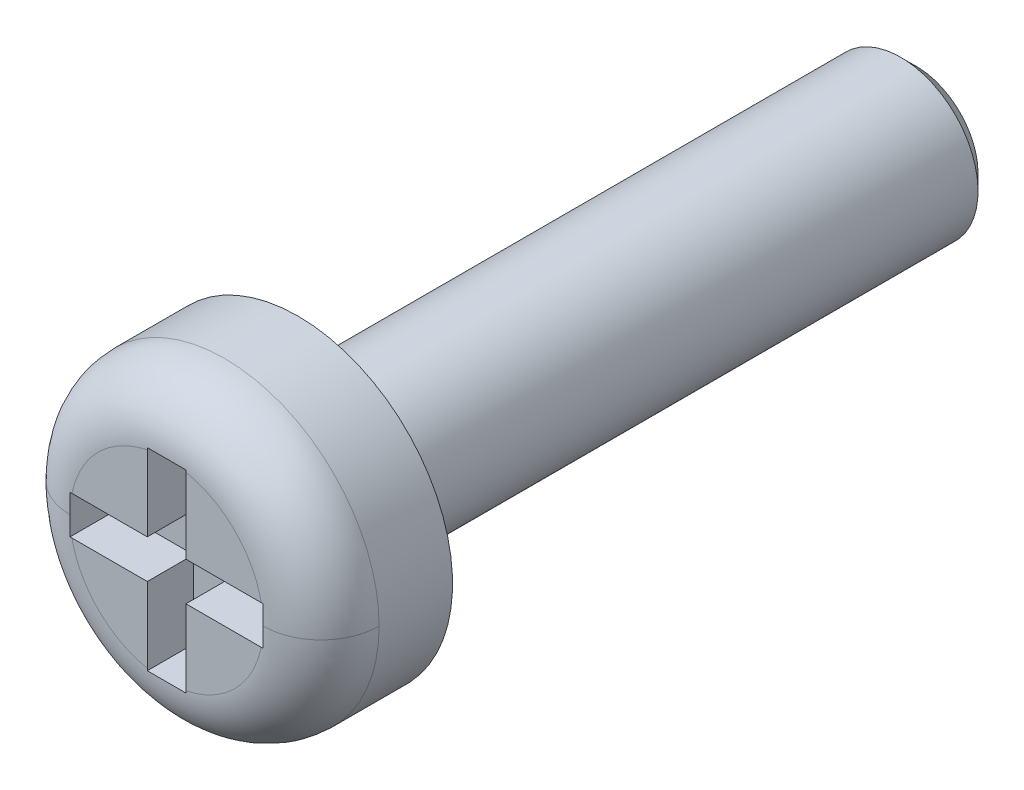
ISO-10303-21;
HEADER;
FILE_DESCRIPTION(('STEP AP214'),'2;1');
FILE_NAME('part.step','',(''),(''),'','','');
FILE_SCHEMA(('AUTOMOTIVE_DESIGN { 1 0 10303 214 1 1 1 1 }'));
ENDSEC;
DATA;
#1=APPLICATION_CONTEXT('core data for automotive mechanical design processes');
#2=APPLICATION_PROTOCOL_DEFINITION('international standard','automotive_design',2000,#1);
#3=PRODUCT_CONTEXT('',#1,'mechanical');
#4=PRODUCT('Part','Part','',(#3));
#5=PRODUCT_RELATED_PRODUCT_CATEGORY('part','',(#4));
#6=PRODUCT_DEFINITION_FORMATION('','',#4);
#7=PRODUCT_DEFINITION_CONTEXT('part definition',#1,'design');
#8=PRODUCT_DEFINITION('design','',#6,#7);
#9=PRODUCT_DEFINITION_SHAPE('','',#8);
#10=(LENGTH_UNIT() NAMED_UNIT(*) SI_UNIT(.MILLI.,.METRE.));
#11=(NAMED_UNIT(*) PLANE_ANGLE_UNIT() SI_UNIT($,.RADIAN.));
#12=(NAMED_UNIT(*) SI_UNIT($,.STERADIAN.) SOLID_ANGLE_UNIT());
#13=UNCERTAINTY_MEASURE_WITH_UNIT(LENGTH_MEASURE(1.E-05),#10,'distance_accuracy_value','');
#14=(GEOMETRIC_REPRESENTATION_CONTEXT(3) GLOBAL_UNCERTAINTY_ASSIGNED_CONTEXT((#13)) GLOBAL_UNIT_ASSIGNED_CONTEXT((#10,
#11,#12)) REPRESENTATION_CONTEXT('',''));
#15=CARTESIAN_POINT('',(0.,0.,0.));
#16=DIRECTION('',(0.,0.,1.));
#17=DIRECTION('',(1.,0.,0.));
#18=AXIS2_PLACEMENT_3D('',#15,#16,#17);
#19=CARTESIAN_POINT('',(-0.25,1.25,1.09999999999999));
#20=DIRECTION('',(0.,0.,-1.));
#21=DIRECTION('',(0.,1.,0.));
#22=AXIS2_PLACEMENT_3D('',#19,#20,#21);
#23=PLANE('',#22);
#24=DIRECTION('',(0.,-1.,0.));
#25=VECTOR('',#24,1.);
#26=CARTESIAN_POINT('',(-1.25,0.250000000000014,1.09999999999999));
#27=LINE('',#26,#25);
#28=CARTESIAN_POINT('',(-1.25,0.250000000000014,1.09999999999999));
#29=VERTEX_POINT('',#28);
#30=CARTESIAN_POINT('',(-1.25,-0.249999999999986,1.09999999999999));
#31=VERTEX_POINT('',#30);
#32=EDGE_CURVE('E157',#29,#31,#27,.T.);
#33=ORIENTED_EDGE('',*,*,#32,.T.);
#34=DIRECTION('',(1.,0.,0.));
#35=VECTOR('',#34,1.);
#36=CARTESIAN_POINT('',(-1.25000000000001,-0.249999999999986,1.09999999999999));
#37=LINE('',#36,#35);
#38=CARTESIAN_POINT('',(-0.250000000000004,-0.249999999999998,1.09999999999999));
#39=VERTEX_POINT('',#38);
#40=EDGE_CURVE('E153',#31,#39,#37,.T.);
#41=ORIENTED_EDGE('',*,*,#40,.T.);
#42=DIRECTION('',(0.,-1.,0.));
#43=VECTOR('',#42,1.);
#44=CARTESIAN_POINT('',(-0.250000000000011,-1.25,1.09999999999999));
#45=LINE('',#44,#43);
#46=CARTESIAN_POINT('',(-0.250000000000011,-1.25,1.09999999999999));
#47=VERTEX_POINT('',#46);
#48=EDGE_CURVE('E321',#39,#47,#45,.T.);
#49=ORIENTED_EDGE('',*,*,#48,.T.);
#50=DIRECTION('',(1.,0.,0.));
#51=VECTOR('',#50,1.);
#52=CARTESIAN_POINT('',(-0.250000000000011,-1.25,1.09999999999999));
#53=LINE('',#52,#51);
#54=CARTESIAN_POINT('',(0.24999999999999,-1.25,1.09999999999999));
#55=VERTEX_POINT('',#54);
#56=EDGE_CURVE('E311',#47,#55,#53,.T.);
#57=ORIENTED_EDGE('',*,*,#56,.T.);
#58=DIRECTION('',(0.,1.,0.));
#59=VECTOR('',#58,1.);
#60=CARTESIAN_POINT('',(0.24999999999999,-1.25,1.09999999999999));
#61=LINE('',#60,#59);
#62=CARTESIAN_POINT('',(0.249999999999998,-0.249999999999999,1.09999999999999));
#63=VERTEX_POINT('',#62);
#64=EDGE_CURVE('E278',#55,#63,#61,.T.);
#65=ORIENTED_EDGE('',*,*,#64,.T.);
#66=DIRECTION('',(1.,0.,0.));
#67=VECTOR('',#66,1.);
#68=CARTESIAN_POINT('',(1.25,-0.250000000000004,1.09999999999999));
#69=LINE('',#68,#67);
#70=CARTESIAN_POINT('',(1.25,-0.250000000000004,1.09999999999999));
#71=VERTEX_POINT('',#70);
#72=EDGE_CURVE('E279',#63,#71,#69,.T.);
#73=ORIENTED_EDGE('',*,*,#72,.T.);
#74=DIRECTION('',(0.,1.,0.));
#75=VECTOR('',#74,1.);
#76=CARTESIAN_POINT('',(1.25,-0.250000000000004,1.09999999999999));
#77=LINE('',#76,#75);
#78=CARTESIAN_POINT('',(1.25,0.249999999999997,1.09999999999999));
#79=VERTEX_POINT('',#78);
#80=EDGE_CURVE('E302',#71,#79,#77,.T.);
#81=ORIENTED_EDGE('',*,*,#80,.T.);
#82=DIRECTION('',(-1.,0.,0.));
#83=VECTOR('',#82,1.);
#84=CARTESIAN_POINT('',(1.25,0.249999999999997,1.09999999999999));
#85=LINE('',#84,#83);
#86=CARTESIAN_POINT('',(0.249999999999996,0.250000000000001,1.09999999999999));
#87=VERTEX_POINT('',#86);
#88=EDGE_CURVE('E397',#79,#87,#85,.T.);
#89=ORIENTED_EDGE('',*,*,#88,.T.);
#90=DIRECTION('',(0.,1.,0.));
#91=VECTOR('',#90,1.);
#92=CARTESIAN_POINT('',(0.249999999999997,1.25,1.09999999999999));
#93=LINE('',#92,#91);
#94=CARTESIAN_POINT('',(0.249999999999997,1.25,1.09999999999999));
#95=VERTEX_POINT('',#94);
#96=EDGE_CURVE('E414',#87,#95,#93,.T.);
#97=ORIENTED_EDGE('',*,*,#96,.T.);
#98=DIRECTION('',(-1.,0.,0.));
#99=VECTOR('',#98,1.);
#100=CARTESIAN_POINT('',(0.249999999999997,1.25,1.09999999999999));
#101=LINE('',#100,#99);
#102=CARTESIAN_POINT('',(-0.25,1.25,1.09999999999999));
#103=VERTEX_POINT('',#102);
#104=EDGE_CURVE('E419',#95,#103,#101,.T.);
#105=ORIENTED_EDGE('',*,*,#104,.T.);
#106=DIRECTION('',(0.,-1.,0.));
#107=VECTOR('',#106,1.);
#108=CARTESIAN_POINT('',(-0.25,1.25,1.09999999999999));
#109=LINE('',#108,#107);
#110=CARTESIAN_POINT('',(-0.25,0.250000000000001,1.09999999999999));
#111=VERTEX_POINT('',#110);
#112=EDGE_CURVE('E570',#103,#111,#109,.T.);
#113=ORIENTED_EDGE('',*,*,#112,.T.);
#114=DIRECTION('',(-1.,0.,0.));
#115=VECTOR('',#114,1.);
#116=CARTESIAN_POINT('',(-1.25,0.250000000000014,1.09999999999999));
#117=LINE('',#116,#115);
#118=EDGE_CURVE('E156',#111,#29,#117,.T.);
#119=ORIENTED_EDGE('',*,*,#118,.T.);
#120=EDGE_LOOP('',(#33,#41,#49,#57,#65,#73,#81,#89,#97,#105,#113,#119));
#121=FACE_BOUND('',#120,.T.);
#122=ADVANCED_FACE('F17',(#121),#23,.F.);
#123=CARTESIAN_POINT('',(1.25,-0.250000000000004,1.09999999999999));
#124=DIRECTION('',(0.,-1.,0.));
#125=DIRECTION('',(1.,0.,0.));
#126=AXIS2_PLACEMENT_3D('',#123,#124,#125);
#127=PLANE('',#126);
#128=ORIENTED_EDGE('',*,*,#72,.F.);
#129=DIRECTION('',(0.,0.,1.));
#130=VECTOR('',#129,1.);
#131=CARTESIAN_POINT('',(0.249999999999998,-0.249999999999999,1.09999999999999));
#132=LINE('',#131,#130);
#133=CARTESIAN_POINT('',(0.249999999999998,-0.250000000000001,1.70000000000001));
#134=VERTEX_POINT('',#133);
#135=EDGE_CURVE('E306',#63,#134,#132,.T.);
#136=ORIENTED_EDGE('',*,*,#135,.T.);
#137=DIRECTION('',(1.,0.,0.));
#138=VECTOR('',#137,1.);
#139=CARTESIAN_POINT('',(0.,-0.250000000000003,1.70000000000001));
#140=LINE('',#139,#138);
#141=CARTESIAN_POINT('',(1.22474487139159,-0.250000000000003,1.70000000000001));
#142=VERTEX_POINT('',#141);
#143=EDGE_CURVE('E270',#142,#134,#140,.F.);
#144=ORIENTED_EDGE('',*,*,#143,.F.);
#145=CARTESIAN_POINT('',(1.25,-0.250000000000004,1.69959135266857));
#146=CARTESIAN_POINT('',(1.24579191431409,-0.250000000000004,1.69972759178637));
#147=CARTESIAN_POINT('',(1.24158327742043,-0.250000000000004,1.69982976528955));
#148=CARTESIAN_POINT('',(1.23316490121763,-0.250000000000004,1.69996598106669));
#149=CARTESIAN_POINT('',(1.22895516190848,-0.250000000000004,1.70000002334066));
#150=CARTESIAN_POINT('',(1.22474487139158,-0.250000000000004,1.70000000000001));
#151=B_SPLINE_CURVE_WITH_KNOTS('',3,(#145,#146,#147,#148,#149,#150),.UNSPECIFIED.,.F.,.F.,(4,2,
4),(0.,0.0126296308475991,0.0252592616951986),.UNSPECIFIED.);
#152=CARTESIAN_POINT('',(1.25,-0.250000000000004,1.69959135266857));
#153=VERTEX_POINT('',#152);
#154=EDGE_CURVE('E251',#153,#142,#151,.T.);
#155=ORIENTED_EDGE('',*,*,#154,.F.);
#156=DIRECTION('',(0.,0.,1.));
#157=VECTOR('',#156,1.);
#158=CARTESIAN_POINT('',(1.25,-0.250000000000004,1.09999999999999));
#159=LINE('',#158,#157);
#160=EDGE_CURVE('E301',#153,#71,#159,.F.);
#161=ORIENTED_EDGE('',*,*,#160,.T.);
#162=EDGE_LOOP('',(#128,#136,#144,#155,#161));
#163=FACE_BOUND('',#162,.T.);
#164=ADVANCED_FACE('F252',(#163),#127,.F.);
#165=CARTESIAN_POINT('',(0.,0.,1.70000000000001));
#166=DIRECTION('',(0.,0.,1.));
#167=DIRECTION('',(0.,-1.,0.));
#168=AXIS2_PLACEMENT_3D('',#165,#166,#167);
#169=PLANE('',#168);
#170=CARTESIAN_POINT('',(1.25,0.,1.70000000000001));
#171=CARTESIAN_POINT('',(1.25,-2.49999999999999,1.70000000000001));
#172=CARTESIAN_POINT('',(-1.25,-2.49999999999999,1.70000000000001));
#173=CARTESIAN_POINT('',(-1.25,0.,1.70000000000001));
#174=(BOUNDED_CURVE() B_SPLINE_CURVE(3,(#170,#171,#172,#173),.UNSPECIFIED.,.F.,
.F.) B_SPLINE_CURVE_WITH_KNOTS((4,4),(0.,1.),
.UNSPECIFIED.) CURVE() GEOMETRIC_REPRESENTATION_ITEM() RATIONAL_B_SPLINE_CURVE((1.,
0.333333333333333,0.333333333333333,1.)) REPRESENTATION_ITEM(''));
#175=CARTESIAN_POINT('',(0.24999999999999,-1.22474487139158,1.70000000000001));
#176=VERTEX_POINT('',#175);
#177=EDGE_CURVE('E284',#142,#176,#174,.T.);
#178=ORIENTED_EDGE('',*,*,#177,.F.);
#179=ORIENTED_EDGE('',*,*,#143,.T.);
#180=DIRECTION('',(0.,1.,0.));
#181=VECTOR('',#180,1.);
#182=CARTESIAN_POINT('',(0.24999999999999,-1.25,1.70000000000001));
#183=LINE('',#182,#181);
#184=EDGE_CURVE('E308',#134,#176,#183,.F.);
#185=ORIENTED_EDGE('',*,*,#184,.T.);
#186=EDGE_LOOP('',(#178,#179,#185));
#187=FACE_BOUND('',#186,.T.);
#188=ADVANCED_FACE('F256',(#187),#169,.T.);
#189=CARTESIAN_POINT('',(0.24999999999999,-1.25,1.09999999999999));
#190=DIRECTION('',(1.,0.,0.));
#191=DIRECTION('',(0.,1.,0.));
#192=AXIS2_PLACEMENT_3D('',#189,#190,#191);
#193=PLANE('',#192);
#194=ORIENTED_EDGE('',*,*,#135,.F.);
#195=ORIENTED_EDGE('',*,*,#64,.F.);
#196=DIRECTION('',(0.,0.,1.));
#197=VECTOR('',#196,1.);
#198=CARTESIAN_POINT('',(0.24999999999999,-1.25,1.09999999999999));
#199=LINE('',#198,#197);
#200=CARTESIAN_POINT('',(0.250000000000024,-1.25,1.69959135266857));
#201=VERTEX_POINT('',#200);
#202=EDGE_CURVE('E313',#55,#201,#199,.T.);
#203=ORIENTED_EDGE('',*,*,#202,.T.);
#204=CARTESIAN_POINT('',(0.249999999999991,-1.22474487139159,1.70000000000001));
#205=CARTESIAN_POINT('',(0.24999999999999,-1.22895516190857,1.70000002334065));
#206=CARTESIAN_POINT('',(0.24999999999999,-1.2331649012178,1.69996598106669));
#207=CARTESIAN_POINT('',(0.24999999999999,-1.24158327742078,1.69982976528954));
#208=CARTESIAN_POINT('',(0.24999999999999,-1.24579191431452,1.69972759178635));
#209=CARTESIAN_POINT('',(0.24999999999999,-1.25000000000051,1.69959135266856));
#210=B_SPLINE_CURVE_WITH_KNOTS('',3,(#204,#205,#206,#207,#208,#209),.UNSPECIFIED.,.F.,.F.,(4,2,
4),(0.,0.0126296308478546,0.0252592616957088),.UNSPECIFIED.);
#211=EDGE_CURVE('E287',#176,#201,#210,.T.);
#212=ORIENTED_EDGE('',*,*,#211,.F.);
#213=ORIENTED_EDGE('',*,*,#184,.F.);
#214=EDGE_LOOP('',(#194,#195,#203,#212,#213));
#215=FACE_BOUND('',#214,.T.);
#216=ADVANCED_FACE('F260',(#215),#193,.F.);
#217=CARTESIAN_POINT('',(-0.250000000000011,-1.25,1.09999999999999));
#218=DIRECTION('',(0.,-1.,0.));
#219=DIRECTION('',(1.,0.,0.));
#220=AXIS2_PLACEMENT_3D('',#217,#218,#219);
#221=PLANE('',#220);
#222=ORIENTED_EDGE('',*,*,#56,.F.);
#223=DIRECTION('',(0.,0.,1.));
#224=VECTOR('',#223,1.);
#225=CARTESIAN_POINT('',(-0.250000000000011,-1.25,1.09999999999999));
#226=LINE('',#225,#224);
#227=CARTESIAN_POINT('',(-0.250000000000011,-1.25000000000025,1.69959135266856));
#228=VERTEX_POINT('',#227);
#229=EDGE_CURVE('E323',#47,#228,#226,.T.);
#230=ORIENTED_EDGE('',*,*,#229,.T.);
#231=CARTESIAN_POINT('',(0.250000000000058,-1.25,1.69959135266857));
#232=CARTESIAN_POINT('',(0.208333536894497,-1.25,1.6998292338899));
#233=CARTESIAN_POINT('',(0.166666879369875,-1.25,1.69993139567793));
#234=CARTESIAN_POINT('',(0.0833334812298184,-1.25,1.70001677857409));
#235=CARTESIAN_POINT('',(0.041666740614904,-1.25,1.70000000000001));
#236=CARTESIAN_POINT('',(-0.0416667406149247,-1.25,1.70000000000001));
#237=CARTESIAN_POINT('',(-0.0833334812298391,-1.25,1.70001677857409));
#238=CARTESIAN_POINT('',(-0.166666879369895,-1.25,1.69993139567793));
#239=CARTESIAN_POINT('',(-0.208333536894518,-1.25,1.6998292338899));
#240=CARTESIAN_POINT('',(-0.250000000000079,-1.25,1.69959135266857));
#241=B_SPLINE_CURVE_WITH_KNOTS('',3,(#231,#232,#233,#234,#235,#236,#237,#238,#239,#240),
.UNSPECIFIED.,.F.,.F.,(4,2,2,2,4),(0.,0.125000461306252,0.250000588628008,0.375000715949763,
0.500001177256015),.UNSPECIFIED.);
#242=EDGE_CURVE('E234',#201,#228,#241,.T.);
#243=ORIENTED_EDGE('',*,*,#242,.F.);
#244=ORIENTED_EDGE('',*,*,#202,.F.);
#245=EDGE_LOOP('',(#222,#230,#243,#244));
#246=FACE_BOUND('',#245,.T.);
#247=ADVANCED_FACE('F612',(#246),#221,.F.);
#248=CARTESIAN_POINT('',(-0.250000000000011,-1.25,1.09999999999999));
#249=DIRECTION('',(-1.,0.,0.));
#250=DIRECTION('',(0.,-1.,0.));
#251=AXIS2_PLACEMENT_3D('',#248,#249,#250);
#252=PLANE('',#251);
#253=ORIENTED_EDGE('',*,*,#48,.F.);
#254=DIRECTION('',(0.,0.,1.));
#255=VECTOR('',#254,1.);
#256=CARTESIAN_POINT('',(-0.250000000000004,-0.249999999999998,1.09999999999999));
#257=LINE('',#256,#255);
#258=CARTESIAN_POINT('',(-0.250000000000006,-0.249999999999998,1.70000000000001));
#259=VERTEX_POINT('',#258);
#260=EDGE_CURVE('E586',#39,#259,#257,.T.);
#261=ORIENTED_EDGE('',*,*,#260,.T.);
#262=DIRECTION('',(0.,-1.,0.));
#263=VECTOR('',#262,1.);
#264=CARTESIAN_POINT('',(-0.250000000000011,0.,1.70000000000001));
#265=LINE('',#264,#263);
#266=CARTESIAN_POINT('',(-0.250000000000011,-1.22474487139158,1.70000000000001));
#267=VERTEX_POINT('',#266);
#268=EDGE_CURVE('E324',#267,#259,#265,.F.);
#269=ORIENTED_EDGE('',*,*,#268,.F.);
#270=CARTESIAN_POINT('',(-0.250000000000011,-1.25000000000051,1.69959135266856));
#271=CARTESIAN_POINT('',(-0.250000000000011,-1.24579191431451,1.69972759178635));
#272=CARTESIAN_POINT('',(-0.250000000000011,-1.24158327742077,1.69982976528954));
#273=CARTESIAN_POINT('',(-0.25000000000001,-1.2331649012178,1.69996598106669));
#274=CARTESIAN_POINT('',(-0.25000000000001,-1.22895516190856,1.70000002334066));
#275=CARTESIAN_POINT('',(-0.25000000000001,-1.22474487139158,1.70000000000001));
#276=B_SPLINE_CURVE_WITH_KNOTS('',3,(#270,#271,#272,#273,#274,#275),.UNSPECIFIED.,.F.,.F.,(4,2,
4),(0.,0.0126296308478549,0.0252592616957097),.UNSPECIFIED.);
#277=EDGE_CURVE('E172',#228,#267,#276,.T.);
#278=ORIENTED_EDGE('',*,*,#277,.F.);
#279=ORIENTED_EDGE('',*,*,#229,.F.);
#280=EDGE_LOOP('',(#253,#261,#269,#278,#279));
#281=FACE_BOUND('',#280,.T.);
#282=ADVANCED_FACE('F609',(#281),#252,.F.);
#283=CARTESIAN_POINT('',(0.,0.,1.70000000000001));
#284=DIRECTION('',(0.,0.,1.));
#285=DIRECTION('',(0.,-1.,0.));
#286=AXIS2_PLACEMENT_3D('',#283,#284,#285);
#287=PLANE('',#286);
#288=CARTESIAN_POINT('',(1.25,0.,1.70000000000001));
#289=CARTESIAN_POINT('',(1.25,-2.49999999999999,1.70000000000001));
#290=CARTESIAN_POINT('',(-1.25,-2.49999999999999,1.70000000000001));
#291=CARTESIAN_POINT('',(-1.25,0.,1.70000000000001));
#292=(BOUNDED_CURVE() B_SPLINE_CURVE(3,(#288,#289,#290,#291),.UNSPECIFIED.,.F.,
.F.) B_SPLINE_CURVE_WITH_KNOTS((4,4),(0.,1.),
.UNSPECIFIED.) CURVE() GEOMETRIC_REPRESENTATION_ITEM() RATIONAL_B_SPLINE_CURVE((1.,
0.333333333333333,0.333333333333333,1.)) REPRESENTATION_ITEM(''));
#293=CARTESIAN_POINT('',(-1.22474487139158,-0.249999999999986,1.70000000000001));
#294=VERTEX_POINT('',#293);
#295=EDGE_CURVE('E168',#267,#294,#292,.T.);
#296=ORIENTED_EDGE('',*,*,#295,.F.);
#297=ORIENTED_EDGE('',*,*,#268,.T.);
#298=DIRECTION('',(1.,0.,0.));
#299=VECTOR('',#298,1.);
#300=CARTESIAN_POINT('',(-1.25000000000001,-0.249999999999986,1.70000000000001));
#301=LINE('',#300,#299);
#302=EDGE_CURVE('E582',#259,#294,#301,.F.);
#303=ORIENTED_EDGE('',*,*,#302,.T.);
#304=EDGE_LOOP('',(#296,#297,#303));
#305=FACE_BOUND('',#304,.T.);
#306=ADVANCED_FACE('F601',(#305),#287,.T.);
#307=CARTESIAN_POINT('',(-1.25000000000001,-0.249999999999986,1.09999999999999));
#308=DIRECTION('',(0.,-1.,0.));
#309=DIRECTION('',(1.,0.,0.));
#310=AXIS2_PLACEMENT_3D('',#307,#308,#309);
#311=PLANE('',#310);
#312=ORIENTED_EDGE('',*,*,#260,.F.);
#313=ORIENTED_EDGE('',*,*,#40,.F.);
#314=DIRECTION('',(0.,0.,1.));
#315=VECTOR('',#314,1.);
#316=CARTESIAN_POINT('',(-1.25,-0.249999999999986,1.09999999999999));
#317=LINE('',#316,#315);
#318=CARTESIAN_POINT('',(-1.25,-0.249999999999987,1.69959135266857));
#319=VERTEX_POINT('',#318);
#320=EDGE_CURVE('E145',#31,#319,#317,.T.);
#321=ORIENTED_EDGE('',*,*,#320,.T.);
#322=CARTESIAN_POINT('',(-1.22474487139159,-0.249999999999987,1.70000000000001));
#323=CARTESIAN_POINT('',(-1.22895516190848,-0.249999999999987,1.70000002334066));
#324=CARTESIAN_POINT('',(-1.23316490121763,-0.249999999999987,1.69996598106669));
#325=CARTESIAN_POINT('',(-1.24158327742044,-0.249999999999986,1.69982976528955));
#326=CARTESIAN_POINT('',(-1.24579191431409,-0.249999999999986,1.69972759178637));
#327=CARTESIAN_POINT('',(-1.25000000000001,-0.249999999999986,1.69959135266857));
#328=B_SPLINE_CURVE_WITH_KNOTS('',3,(#322,#323,#324,#325,#326,#327),.UNSPECIFIED.,.F.,.F.,(4,2,
4),(0.,0.012629630847601,0.0252592616952015),.UNSPECIFIED.);
#329=EDGE_CURVE('E151',#294,#319,#328,.T.);
#330=ORIENTED_EDGE('',*,*,#329,.F.);
#331=ORIENTED_EDGE('',*,*,#302,.F.);
#332=EDGE_LOOP('',(#312,#313,#321,#330,#331));
#333=FACE_BOUND('',#332,.T.);
#334=ADVANCED_FACE('F148',(#333),#311,.F.);
#335=CARTESIAN_POINT('',(-1.25,0.250000000000014,1.09999999999999));
#336=DIRECTION('',(-1.,0.,0.));
#337=DIRECTION('',(0.,-1.,0.));
#338=AXIS2_PLACEMENT_3D('',#335,#336,#337);
#339=PLANE('',#338);
#340=ORIENTED_EDGE('',*,*,#320,.F.);
#341=ORIENTED_EDGE('',*,*,#32,.F.);
#342=DIRECTION('',(0.,0.,1.));
#343=VECTOR('',#342,1.);
#344=CARTESIAN_POINT('',(-1.25,0.250000000000014,1.09999999999999));
#345=LINE('',#344,#343);
#346=CARTESIAN_POINT('',(-1.25,0.250000000000014,1.69959135266857));
#347=VERTEX_POINT('',#346);
#348=EDGE_CURVE('E578',#29,#347,#345,.T.);
#349=ORIENTED_EDGE('',*,*,#348,.T.);
#350=CARTESIAN_POINT('',(-1.25,0.,1.70000000000001));
#351=CARTESIAN_POINT('',(-1.25,0.0208334063916285,1.69999784579778));
#352=CARTESIAN_POINT('',(-1.25,0.0416668094992225,1.69999999858943));
#353=CARTESIAN_POINT('',(-1.25,0.0833335717079371,1.69999675022065));
#354=CARTESIAN_POINT('',(-1.25,0.104166930809061,1.69999134907561));
#355=CARTESIAN_POINT('',(-1.25,0.145833672240226,1.69995682500012));
#356=CARTESIAN_POINT('',(-1.25,0.16666705457027,1.69992770204715));
#357=CARTESIAN_POINT('',(-1.25,0.208333684297754,1.69981152660783));
#358=CARTESIAN_POINT('',(-1.25,0.229166931694831,1.69972447400347));
#359=CARTESIAN_POINT('',(-1.24999999999999,0.250000000000015,1.69959135266857));
#360=B_SPLINE_CURVE_WITH_KNOTS('',3,(#350,#351,#352,#353,#354,#355,#356,#357,#358,#359),
.UNSPECIFIED.,.F.,.F.,(4,2,2,2,4),(0.,0.0625002118449795,0.125000296368392,0.187500440270153,
0.250000711493359),.UNSPECIFIED.);
#361=CARTESIAN_POINT('',(-1.25,0.,1.70000000000001));
#362=VERTEX_POINT('',#361);
#363=EDGE_CURVE('E162',#362,#347,#360,.T.);
#364=ORIENTED_EDGE('',*,*,#363,.F.);
#365=CARTESIAN_POINT('',(-1.25000000000001,-0.249999999999987,1.69959135266857));
#366=CARTESIAN_POINT('',(-1.25,-0.229166931694806,1.69972447400347));
#367=CARTESIAN_POINT('',(-1.25,-0.20833368429773,1.69981152660783));
#368=CARTESIAN_POINT('',(-1.25,-0.166667054570252,1.69992770204715));
#369=CARTESIAN_POINT('',(-1.25,-0.14583367224021,1.69995682500012));
#370=CARTESIAN_POINT('',(-1.25,-0.104166930809049,1.69999134907561));
#371=CARTESIAN_POINT('',(-1.25,-0.0833335717079276,1.69999675022065));
#372=CARTESIAN_POINT('',(-1.25,-0.0416668094992175,1.69999999858943));
#373=CARTESIAN_POINT('',(-1.25,-0.0208334063916258,1.69999784579778));
#374=CARTESIAN_POINT('',(-1.24999999999999,0.,1.70000000000001));
#375=B_SPLINE_CURVE_WITH_KNOTS('',3,(#365,#366,#367,#368,#369,#370,#371,#372,#373,#374),
.UNSPECIFIED.,.F.,.F.,(4,2,2,2,4),(0.,0.0625002712231991,0.125000415124952,0.187500499648359,
0.250000711493331),.UNSPECIFIED.);
#376=EDGE_CURVE('E20',#319,#362,#375,.T.);
#377=ORIENTED_EDGE('',*,*,#376,.F.);
#378=EDGE_LOOP('',(#340,#341,#349,#364,#377));
#379=FACE_BOUND('',#378,.T.);
#380=ADVANCED_FACE('F160',(#379),#339,.F.);
#381=CARTESIAN_POINT('',(-1.25,0.250000000000014,1.09999999999999));
#382=DIRECTION('',(0.,1.,0.));
#383=DIRECTION('',(-1.,0.,0.));
#384=AXIS2_PLACEMENT_3D('',#381,#382,#383);
#385=PLANE('',#384);
#386=ORIENTED_EDGE('',*,*,#118,.F.);
#387=DIRECTION('',(0.,0.,1.));
#388=VECTOR('',#387,1.);
#389=CARTESIAN_POINT('',(-0.25,0.250000000000001,1.09999999999999));
#390=LINE('',#389,#388);
#391=CARTESIAN_POINT('',(-0.25,0.250000000000006,1.70000000000001));
#392=VERTEX_POINT('',#391);
#393=EDGE_CURVE('E424',#111,#392,#390,.T.);
#394=ORIENTED_EDGE('',*,*,#393,.T.);
#395=DIRECTION('',(1.,0.,0.));
#396=VECTOR('',#395,1.);
#397=CARTESIAN_POINT('',(0.,0.250000000000014,1.70000000000001));
#398=LINE('',#397,#396);
#399=CARTESIAN_POINT('',(-1.22474487139159,0.250000000000014,1.70000000000001));
#400=VERTEX_POINT('',#399);
#401=EDGE_CURVE('E438',#400,#392,#398,.T.);
#402=ORIENTED_EDGE('',*,*,#401,.F.);
#403=CARTESIAN_POINT('',(-1.25,0.250000000000014,1.69959135266857));
#404=CARTESIAN_POINT('',(-1.24579191431409,0.250000000000014,1.69972759178637));
#405=CARTESIAN_POINT('',(-1.24158327742043,0.250000000000014,1.69982976528955));
#406=CARTESIAN_POINT('',(-1.23316490121763,0.250000000000014,1.69996598106669));
#407=CARTESIAN_POINT('',(-1.22895516190848,0.250000000000014,1.70000002334066));
#408=CARTESIAN_POINT('',(-1.22474487139158,0.250000000000013,1.70000000000001));
#409=B_SPLINE_CURVE_WITH_KNOTS('',3,(#403,#404,#405,#406,#407,#408),.UNSPECIFIED.,.F.,.F.,(4,2,
4),(0.,0.0126296308476002,0.0252592616952001),.UNSPECIFIED.);
#410=EDGE_CURVE('E462',#347,#400,#409,.T.);
#411=ORIENTED_EDGE('',*,*,#410,.F.);
#412=ORIENTED_EDGE('',*,*,#348,.F.);
#413=EDGE_LOOP('',(#386,#394,#402,#411,#412));
#414=FACE_BOUND('',#413,.T.);
#415=ADVANCED_FACE('F451',(#414),#385,.F.);
#416=CARTESIAN_POINT('',(0.,0.,1.70000000000001));
#417=DIRECTION('',(0.,0.,1.));
#418=DIRECTION('',(0.,-1.,0.));
#419=AXIS2_PLACEMENT_3D('',#416,#417,#418);
#420=PLANE('',#419);
#421=ORIENTED_EDGE('',*,*,#401,.T.);
#422=DIRECTION('',(0.,-1.,0.));
#423=VECTOR('',#422,1.);
#424=CARTESIAN_POINT('',(-0.25,1.25,1.70000000000001));
#425=LINE('',#424,#423);
#426=CARTESIAN_POINT('',(-0.249999999999999,1.22474487139158,1.70000000000001));
#427=VERTEX_POINT('',#426);
#428=EDGE_CURVE('E422',#392,#427,#425,.F.);
#429=ORIENTED_EDGE('',*,*,#428,.T.);
#430=CARTESIAN_POINT('',(-1.25,0.,1.70000000000001));
#431=CARTESIAN_POINT('',(-1.25,2.5,1.70000000000001));
#432=CARTESIAN_POINT('',(1.25,2.5,1.70000000000001));
#433=CARTESIAN_POINT('',(1.25,0.,1.70000000000001));
#434=(BOUNDED_CURVE() B_SPLINE_CURVE(3,(#430,#431,#432,#433),.UNSPECIFIED.,.F.,
.F.) B_SPLINE_CURVE_WITH_KNOTS((4,4),(0.,1.),
.UNSPECIFIED.) CURVE() GEOMETRIC_REPRESENTATION_ITEM() RATIONAL_B_SPLINE_CURVE((1.,
0.333333333333333,0.333333333333333,1.)) REPRESENTATION_ITEM(''));
#435=EDGE_CURVE('E432',#400,#427,#434,.T.);
#436=ORIENTED_EDGE('',*,*,#435,.F.);
#437=EDGE_LOOP('',(#421,#429,#436));
#438=FACE_BOUND('',#437,.T.);
#439=ADVANCED_FACE('F440',(#438),#420,.T.);
#440=CARTESIAN_POINT('',(-0.25,1.25,1.09999999999999));
#441=DIRECTION('',(-1.,0.,0.));
#442=DIRECTION('',(0.,-1.,0.));
#443=AXIS2_PLACEMENT_3D('',#440,#441,#442);
#444=PLANE('',#443);
#445=ORIENTED_EDGE('',*,*,#393,.F.);
#446=ORIENTED_EDGE('',*,*,#112,.F.);
#447=DIRECTION('',(0.,0.,1.));
#448=VECTOR('',#447,1.);
#449=CARTESIAN_POINT('',(-0.25,1.25,1.09999999999999));
#450=LINE('',#449,#448);
#451=CARTESIAN_POINT('',(-0.250000000000034,1.25,1.69959135266857));
#452=VERTEX_POINT('',#451);
#453=EDGE_CURVE('E417',#103,#452,#450,.T.);
#454=ORIENTED_EDGE('',*,*,#453,.T.);
#455=CARTESIAN_POINT('',(-0.250000000000001,1.22474487139159,1.70000000000001));
#456=CARTESIAN_POINT('',(-0.250000000000001,1.22895516190857,1.70000002334066));
#457=CARTESIAN_POINT('',(-0.25,1.2331649012178,1.69996598106669));
#458=CARTESIAN_POINT('',(-0.25,1.24158327742078,1.69982976528954));
#459=CARTESIAN_POINT('',(-0.25,1.24579191431452,1.69972759178635));
#460=CARTESIAN_POINT('',(-0.25,1.25000000000051,1.69959135266856));
#461=B_SPLINE_CURVE_WITH_KNOTS('',3,(#455,#456,#457,#458,#459,#460),.UNSPECIFIED.,.F.,.F.,(4,2,
4),(0.,0.0126296308478559,0.0252592616957115),.UNSPECIFIED.);
#462=EDGE_CURVE('E469',#427,#452,#461,.T.);
#463=ORIENTED_EDGE('',*,*,#462,.F.);
#464=ORIENTED_EDGE('',*,*,#428,.F.);
#465=EDGE_LOOP('',(#445,#446,#454,#463,#464));
#466=FACE_BOUND('',#465,.T.);
#467=ADVANCED_FACE('F450',(#466),#444,.F.);
#468=CARTESIAN_POINT('',(0.249999999999997,1.25,1.09999999999999));
#469=DIRECTION('',(0.,1.,0.));
#470=DIRECTION('',(-1.,0.,0.));
#471=AXIS2_PLACEMENT_3D('',#468,#469,#470);
#472=PLANE('',#471);
#473=ORIENTED_EDGE('',*,*,#104,.F.);
#474=DIRECTION('',(0.,0.,1.));
#475=VECTOR('',#474,1.);
#476=CARTESIAN_POINT('',(0.249999999999997,1.25,1.09999999999999));
#477=LINE('',#476,#475);
#478=CARTESIAN_POINT('',(0.249999999999997,1.25000000000026,1.69959135266856));
#479=VERTEX_POINT('',#478);
#480=EDGE_CURVE('E398',#95,#479,#477,.T.);
#481=ORIENTED_EDGE('',*,*,#480,.T.);
#482=CARTESIAN_POINT('',(-0.250000000000069,1.25,1.69959135266857));
#483=CARTESIAN_POINT('',(-0.208333536894508,1.25,1.6998292338899));
#484=CARTESIAN_POINT('',(-0.166666879369885,1.25,1.69993139567793));
#485=CARTESIAN_POINT('',(-0.0833334812298299,1.25,1.70001677857409));
#486=CARTESIAN_POINT('',(-0.0416667406149158,1.25,1.70000000000001));
#487=CARTESIAN_POINT('',(0.0416667406149122,1.25,1.70000000000001));
#488=CARTESIAN_POINT('',(0.0833334812298262,1.25,1.70001677857409));
#489=CARTESIAN_POINT('',(0.166666879369882,1.25,1.69993139567793));
#490=CARTESIAN_POINT('',(0.208333536894504,1.25,1.6998292338899));
#491=CARTESIAN_POINT('',(0.250000000000065,1.25,1.69959135266857));
#492=B_SPLINE_CURVE_WITH_KNOTS('',3,(#482,#483,#484,#485,#486,#487,#488,#489,#490,#491),
.UNSPECIFIED.,.F.,.F.,(4,2,2,2,4),(0.,0.125000461306251,0.250000588628006,0.37500071594976,
0.500001177256011),.UNSPECIFIED.);
#493=EDGE_CURVE('E472',#452,#479,#492,.T.);
#494=ORIENTED_EDGE('',*,*,#493,.F.);
#495=ORIENTED_EDGE('',*,*,#453,.F.);
#496=EDGE_LOOP('',(#473,#481,#494,#495));
#497=FACE_BOUND('',#496,.T.);
#498=ADVANCED_FACE('F481',(#497),#472,.F.);
#499=CARTESIAN_POINT('',(0.249999999999997,1.25,1.09999999999999));
#500=DIRECTION('',(1.,0.,0.));
#501=DIRECTION('',(0.,1.,0.));
#502=AXIS2_PLACEMENT_3D('',#499,#500,#501);
#503=PLANE('',#502);
#504=ORIENTED_EDGE('',*,*,#96,.F.);
#505=DIRECTION('',(0.,0.,1.));
#506=VECTOR('',#505,1.);
#507=CARTESIAN_POINT('',(0.249999999999997,0.250000000000001,1.09999999999999));
#508=LINE('',#507,#506);
#509=CARTESIAN_POINT('',(0.249999999999997,0.250000000000001,1.70000000000001));
#510=VERTEX_POINT('',#509);
#511=EDGE_CURVE('E550',#87,#510,#508,.T.);
#512=ORIENTED_EDGE('',*,*,#511,.T.);
#513=DIRECTION('',(0.,-1.,0.));
#514=VECTOR('',#513,1.);
#515=CARTESIAN_POINT('',(0.249999999999997,0.,1.70000000000001));
#516=LINE('',#515,#514);
#517=CARTESIAN_POINT('',(0.249999999999997,1.22474487139159,1.70000000000001));
#518=VERTEX_POINT('',#517);
#519=EDGE_CURVE('E389',#518,#510,#516,.T.);
#520=ORIENTED_EDGE('',*,*,#519,.F.);
#521=CARTESIAN_POINT('',(0.249999999999997,1.25000000000052,1.69959135266856));
#522=CARTESIAN_POINT('',(0.249999999999997,1.24579191431452,1.69972759178636));
#523=CARTESIAN_POINT('',(0.249999999999997,1.24158327742078,1.69982976528954));
#524=CARTESIAN_POINT('',(0.249999999999997,1.2331649012178,1.69996598106669));
#525=CARTESIAN_POINT('',(0.249999999999996,1.22895516190857,1.70000002334066));
#526=CARTESIAN_POINT('',(0.249999999999996,1.22474487139159,1.70000000000001));
#527=B_SPLINE_CURVE_WITH_KNOTS('',3,(#521,#522,#523,#524,#525,#526),.UNSPECIFIED.,.F.,.F.,(4,2,
4),(0.,0.0126296308478554,0.0252592616957108),.UNSPECIFIED.);
#528=EDGE_CURVE('E367',#479,#518,#527,.T.);
#529=ORIENTED_EDGE('',*,*,#528,.F.);
#530=ORIENTED_EDGE('',*,*,#480,.F.);
#531=EDGE_LOOP('',(#504,#512,#520,#529,#530));
#532=FACE_BOUND('',#531,.T.);
#533=ADVANCED_FACE('F378',(#532),#503,.F.);
#534=CARTESIAN_POINT('',(0.,0.,1.70000000000001));
#535=DIRECTION('',(0.,0.,1.));
#536=DIRECTION('',(0.,-1.,0.));
#537=AXIS2_PLACEMENT_3D('',#534,#535,#536);
#538=PLANE('',#537);
#539=CARTESIAN_POINT('',(-1.25,0.,1.70000000000001));
#540=CARTESIAN_POINT('',(-1.25,2.5,1.70000000000001));
#541=CARTESIAN_POINT('',(1.25,2.5,1.70000000000001));
#542=CARTESIAN_POINT('',(1.25,0.,1.70000000000001));
#543=(BOUNDED_CURVE() B_SPLINE_CURVE(3,(#539,#540,#541,#542),.UNSPECIFIED.,.F.,
.F.) B_SPLINE_CURVE_WITH_KNOTS((4,4),(0.,1.),
.UNSPECIFIED.) CURVE() GEOMETRIC_REPRESENTATION_ITEM() RATIONAL_B_SPLINE_CURVE((1.,
0.333333333333333,0.333333333333333,1.)) REPRESENTATION_ITEM(''));
#544=CARTESIAN_POINT('',(1.22474487139159,0.249999999999996,1.70000000000001));
#545=VERTEX_POINT('',#544);
#546=EDGE_CURVE('E361',#518,#545,#543,.T.);
#547=ORIENTED_EDGE('',*,*,#546,.F.);
#548=ORIENTED_EDGE('',*,*,#519,.T.);
#549=DIRECTION('',(-1.,0.,0.));
#550=VECTOR('',#549,1.);
#551=CARTESIAN_POINT('',(1.25,0.249999999999997,1.70000000000001));
#552=LINE('',#551,#550);
#553=EDGE_CURVE('E304',#510,#545,#552,.F.);
#554=ORIENTED_EDGE('',*,*,#553,.T.);
#555=EDGE_LOOP('',(#547,#548,#554));
#556=FACE_BOUND('',#555,.T.);
#557=ADVANCED_FACE('F373',(#556),#538,.T.);
#558=CARTESIAN_POINT('',(1.25,0.249999999999997,1.09999999999999));
#559=DIRECTION('',(0.,1.,0.));
#560=DIRECTION('',(-1.,0.,0.));
#561=AXIS2_PLACEMENT_3D('',#558,#559,#560);
#562=PLANE('',#561);
#563=ORIENTED_EDGE('',*,*,#511,.F.);
#564=ORIENTED_EDGE('',*,*,#88,.F.);
#565=DIRECTION('',(0.,0.,1.));
#566=VECTOR('',#565,1.);
#567=CARTESIAN_POINT('',(1.25,0.249999999999997,1.09999999999999));
#568=LINE('',#567,#566);
#569=CARTESIAN_POINT('',(1.25,0.249999999999997,1.69959135266857));
#570=VERTEX_POINT('',#569);
#571=EDGE_CURVE('E164',#79,#570,#568,.T.);
#572=ORIENTED_EDGE('',*,*,#571,.T.);
#573=CARTESIAN_POINT('',(1.22474487139159,0.249999999999998,1.70000000000001));
#574=CARTESIAN_POINT('',(1.22895516190848,0.249999999999997,1.70000002334066));
#575=CARTESIAN_POINT('',(1.23316490121763,0.249999999999997,1.69996598106669));
#576=CARTESIAN_POINT('',(1.24158327742043,0.249999999999997,1.69982976528955));
#577=CARTESIAN_POINT('',(1.24579191431409,0.249999999999997,1.69972759178637));
#578=CARTESIAN_POINT('',(1.25,0.249999999999997,1.69959135266857));
#579=B_SPLINE_CURVE_WITH_KNOTS('',3,(#573,#574,#575,#576,#577,#578),.UNSPECIFIED.,.F.,.F.,(4,2,
4),(0.,0.0126296308475982,0.0252592616951967),.UNSPECIFIED.);
#580=EDGE_CURVE('E359',#545,#570,#579,.T.);
#581=ORIENTED_EDGE('',*,*,#580,.F.);
#582=ORIENTED_EDGE('',*,*,#553,.F.);
#583=EDGE_LOOP('',(#563,#564,#572,#581,#582));
#584=FACE_BOUND('',#583,.T.);
#585=ADVANCED_FACE('F369',(#584),#562,.F.);
#586=CARTESIAN_POINT('',(1.25,-0.250000000000004,1.09999999999999));
#587=DIRECTION('',(1.,0.,0.));
#588=DIRECTION('',(0.,1.,0.));
#589=AXIS2_PLACEMENT_3D('',#586,#587,#588);
#590=PLANE('',#589);
#591=ORIENTED_EDGE('',*,*,#571,.F.);
#592=ORIENTED_EDGE('',*,*,#80,.F.);
#593=ORIENTED_EDGE('',*,*,#160,.F.);
#594=CARTESIAN_POINT('',(1.25,0.,1.70000000000001));
#595=CARTESIAN_POINT('',(1.25,-0.0208334063916278,1.69999784579778));
#596=CARTESIAN_POINT('',(1.25,-0.0416668094992209,1.69999999858943));
#597=CARTESIAN_POINT('',(1.25,-0.0833335717079338,1.69999675022065));
#598=CARTESIAN_POINT('',(1.25,-0.104166930809057,1.69999134907561));
#599=CARTESIAN_POINT('',(1.25,-0.14583367224022,1.69995682500012));
#600=CARTESIAN_POINT('',(1.25,-0.166667054570264,1.69992770204715));
#601=CARTESIAN_POINT('',(1.25,-0.208333684297745,1.69981152660783));
#602=CARTESIAN_POINT('',(1.25,-0.229166931694822,1.69972447400347));
#603=CARTESIAN_POINT('',(1.24999999999999,-0.250000000000004,1.69959135266857));
#604=B_SPLINE_CURVE_WITH_KNOTS('',3,(#594,#595,#596,#597,#598,#599,#600,#601,#602,#603),
.UNSPECIFIED.,.F.,.F.,(4,2,2,2,4),(0.,0.0625002118449769,0.125000296368387,0.187500440270145,
0.250000711493348),.UNSPECIFIED.);
#605=CARTESIAN_POINT('',(1.25,0.,1.70000000000001));
#606=VERTEX_POINT('',#605);
#607=EDGE_CURVE('E163',#606,#153,#604,.T.);
#608=ORIENTED_EDGE('',*,*,#607,.F.);
#609=CARTESIAN_POINT('',(1.25,0.249999999999997,1.69959135266857));
#610=CARTESIAN_POINT('',(1.25,0.229166931694815,1.69972447400347));
#611=CARTESIAN_POINT('',(1.25,0.208333684297739,1.69981152660783));
#612=CARTESIAN_POINT('',(1.25,0.166667054570259,1.69992770204715));
#613=CARTESIAN_POINT('',(1.25,0.145833672240216,1.69995682500012));
#614=CARTESIAN_POINT('',(1.25,0.104166930809054,1.69999134907561));
#615=CARTESIAN_POINT('',(1.25,0.0833335717079312,1.69999675022065));
#616=CARTESIAN_POINT('',(1.25,0.0416668094992194,1.69999999858943));
#617=CARTESIAN_POINT('',(1.25,0.0208334063916268,1.69999784579778));
#618=CARTESIAN_POINT('',(1.25,0.,1.70000000000001));
#619=B_SPLINE_CURVE_WITH_KNOTS('',3,(#609,#610,#611,#612,#613,#614,#615,#616,#617,#618),
.UNSPECIFIED.,.F.,.F.,(4,2,2,2,4),(0.,0.0625002712232016,0.125000415124958,0.187500499648366,
0.250000711493342),.UNSPECIFIED.);
#620=EDGE_CURVE('E297',#570,#606,#619,.T.);
#621=ORIENTED_EDGE('',*,*,#620,.F.);
#622=EDGE_LOOP('',(#591,#592,#593,#608,#621));
#623=FACE_BOUND('',#622,.T.);
#624=ADVANCED_FACE('F195',(#623),#590,.F.);
#625=CARTESIAN_POINT('',(-1.2393933982822,0.,1.70000000000001));
#626=CARTESIAN_POINT('',(-1.2393933982822,-2.4787867965644,1.70000000000001));
#627=CARTESIAN_POINT('',(1.2393933982822,-2.4787867965644,1.70000000000001));
#628=CARTESIAN_POINT('',(1.2393933982822,0.,1.70000000000001));
#629=CARTESIAN_POINT('',(-1.24292893218813,0.,1.70000000000001));
#630=CARTESIAN_POINT('',(-1.24292893218813,-2.48585786437626,1.70000000000001));
#631=CARTESIAN_POINT('',(1.24292893218813,-2.48585786437626,1.70000000000001));
#632=CARTESIAN_POINT('',(1.24292893218813,0.,1.70000000000001));
#633=CARTESIAN_POINT('',(-1.24646446609406,0.,1.70000000000001));
#634=CARTESIAN_POINT('',(-1.24646446609406,-2.49292893218813,1.70000000000001));
#635=CARTESIAN_POINT('',(1.24646446609406,-2.49292893218813,1.70000000000001));
#636=CARTESIAN_POINT('',(1.24646446609406,0.,1.70000000000001));
#637=CARTESIAN_POINT('',(-1.25,0.,1.70000000000001));
#638=CARTESIAN_POINT('',(-1.25,-2.49999999999999,1.70000000000001));
#639=CARTESIAN_POINT('',(1.25,-2.49999999999999,1.70000000000001));
#640=CARTESIAN_POINT('',(1.25,0.,1.70000000000001));
#641=CARTESIAN_POINT('',(-1.68933982822018,0.,1.70000000000001));
#642=CARTESIAN_POINT('',(-1.68933982822018,-3.37867965644035,1.70000000000001));
#643=CARTESIAN_POINT('',(1.68933982822018,-3.37867965644035,1.70000000000001));
#644=CARTESIAN_POINT('',(1.68933982822018,0.,1.70000000000001));
#645=CARTESIAN_POINT('',(-2.,0.,1.38933982822019));
#646=CARTESIAN_POINT('',(-2.,-4.,1.38933982822019));
#647=CARTESIAN_POINT('',(2.,-4.,1.38933982822019));
#648=CARTESIAN_POINT('',(2.,0.,1.38933982822019));
#649=CARTESIAN_POINT('',(-2.,0.,0.950000000000006));
#650=CARTESIAN_POINT('',(-2.,-4.,0.950000000000006));
#651=CARTESIAN_POINT('',(2.,-4.,0.950000000000006));
#652=CARTESIAN_POINT('',(2.,0.,0.950000000000006));
#653=(BOUNDED_SURFACE() B_SPLINE_SURFACE(3,3,((#625,#626,#627,#628),(#629,#630,#631,#632),(#633,
#634,#635,#636),(#637,#638,#639,#640),(#641,#642,#643,#644),(#645,#646,#647,#648),(#649,#650,
#651,#652)),.UNSPECIFIED.,.F.,.F.,.F.) B_SPLINE_SURFACE_WITH_KNOTS((4,3,4),(4,4),(-0.01,0.,1.),
(0.,1.),.UNSPECIFIED.) GEOMETRIC_REPRESENTATION_ITEM() RATIONAL_B_SPLINE_SURFACE(((1.,
0.333333333333333,0.333333333333333,1.),(1.,0.333333333333333,0.333333333333333,1.),(1.,
0.333333333333333,0.333333333333333,1.),(1.,0.333333333333333,0.333333333333333,1.),
(0.804737854124364,0.268245951374788,0.268245951374788,0.804737854124364),(0.804737854124364,
0.268245951374788,0.268245951374788,0.804737854124364),(1.,0.333333333333333,0.333333333333333,1.))) REPRESENTATION_ITEM('') SURFACE());
#654=CARTESIAN_POINT('',(-1.2393933982822,0.,1.70000000000001));
#655=CARTESIAN_POINT('',(-1.24292893218813,0.,1.70000000000001));
#656=CARTESIAN_POINT('',(-1.24646446609407,0.,1.70000000000001));
#657=CARTESIAN_POINT('',(-1.25,0.,1.70000000000001));
#658=CARTESIAN_POINT('',(-1.68933982822018,0.,1.70000000000001));
#659=CARTESIAN_POINT('',(-2.,0.,1.38933982822019));
#660=CARTESIAN_POINT('',(-2.,0.,0.950000000000006));
#661=(BOUNDED_CURVE() B_SPLINE_CURVE(3,(#654,#655,#656,#657,#658,#659,#660),.UNSPECIFIED.,.F.,
.F.) B_SPLINE_CURVE_WITH_KNOTS((4,3,4),(-0.01,0.,1.),
.UNSPECIFIED.) CURVE() GEOMETRIC_REPRESENTATION_ITEM() RATIONAL_B_SPLINE_CURVE((1.,1.,1.,1.,
0.804737854124365,0.804737854124365,1.)) REPRESENTATION_ITEM(''));
#662=CARTESIAN_POINT('',(-2.,0.,0.950000000000006));
#663=VERTEX_POINT('',#662);
#664=EDGE_CURVE('E40',#663,#362,#661,.F.);
#665=CARTESIAN_POINT('',(0.,0.,0.950000000000006));
#666=DIRECTION('',(0.,0.,-1.));
#667=DIRECTION('',(0.,1.,0.));
#668=AXIS2_PLACEMENT_3D('',#665,#666,#667);
#669=CIRCLE('',#668,2.);
#670=CARTESIAN_POINT('',(2.,0.,0.950000000000006));
#671=VERTEX_POINT('',#670);
#672=EDGE_CURVE('E524',#671,#663,#669,.T.);
#673=CARTESIAN_POINT('',(1.2393933982822,0.,1.70000000000001));
#674=CARTESIAN_POINT('',(1.24292893218813,0.,1.70000000000001));
#675=CARTESIAN_POINT('',(1.24646446609407,0.,1.70000000000001));
#676=CARTESIAN_POINT('',(1.25,0.,1.70000000000001));
#677=CARTESIAN_POINT('',(1.68933982822018,0.,1.70000000000001));
#678=CARTESIAN_POINT('',(2.,0.,1.38933982822019));
#679=CARTESIAN_POINT('',(2.,0.,0.950000000000006));
#680=(BOUNDED_CURVE() B_SPLINE_CURVE(3,(#673,#674,#675,#676,#677,#678,#679),.UNSPECIFIED.,.F.,
.F.) B_SPLINE_CURVE_WITH_KNOTS((4,3,4),(-0.01,0.,1.),
.UNSPECIFIED.) CURVE() GEOMETRIC_REPRESENTATION_ITEM() RATIONAL_B_SPLINE_CURVE((1.,1.,1.,1.,
0.804737854124365,0.804737854124365,1.)) REPRESENTATION_ITEM(''));
#681=EDGE_CURVE('E292',#606,#671,#680,.T.);
#682=ORIENTED_EDGE('',*,*,#295,.T.);
#683=ORIENTED_EDGE('',*,*,#329,.T.);
#684=ORIENTED_EDGE('',*,*,#376,.T.);
#685=ORIENTED_EDGE('',*,*,#664,.F.);
#686=ORIENTED_EDGE('',*,*,#672,.F.);
#687=ORIENTED_EDGE('',*,*,#681,.F.);
#688=ORIENTED_EDGE('',*,*,#607,.T.);
#689=ORIENTED_EDGE('',*,*,#154,.T.);
#690=ORIENTED_EDGE('',*,*,#177,.T.);
#691=ORIENTED_EDGE('',*,*,#211,.T.);
#692=ORIENTED_EDGE('',*,*,#242,.T.);
#693=ORIENTED_EDGE('',*,*,#277,.T.);
#694=EDGE_LOOP('',(#682,#683,#684,#685,#686,#687,#688,#689,#690,#691,#692,#693));
#695=FACE_BOUND('',#694,.T.);
#696=ADVANCED_FACE('F165',(#695),#653,.T.);
#697=CARTESIAN_POINT('',(1.2393933982822,0.,1.70000000000001));
#698=CARTESIAN_POINT('',(1.2393933982822,2.4787867965644,1.70000000000001));
#699=CARTESIAN_POINT('',(-1.2393933982822,2.4787867965644,1.70000000000001));
#700=CARTESIAN_POINT('',(-1.2393933982822,0.,1.70000000000001));
#701=CARTESIAN_POINT('',(1.24292893218813,0.,1.70000000000001));
#702=CARTESIAN_POINT('',(1.24292893218813,2.48585786437626,1.70000000000001));
#703=CARTESIAN_POINT('',(-1.24292893218813,2.48585786437626,1.70000000000001));
#704=CARTESIAN_POINT('',(-1.24292893218813,0.,1.70000000000001));
#705=CARTESIAN_POINT('',(1.24646446609407,0.,1.70000000000001));
#706=CARTESIAN_POINT('',(1.24646446609407,2.49292893218813,1.70000000000001));
#707=CARTESIAN_POINT('',(-1.24646446609407,2.49292893218813,1.70000000000001));
#708=CARTESIAN_POINT('',(-1.24646446609407,0.,1.70000000000001));
#709=CARTESIAN_POINT('',(1.25,0.,1.70000000000001));
#710=CARTESIAN_POINT('',(1.25,2.5,1.70000000000001));
#711=CARTESIAN_POINT('',(-1.25,2.5,1.70000000000001));
#712=CARTESIAN_POINT('',(-1.25,0.,1.70000000000001));
#713=CARTESIAN_POINT('',(1.68933982822018,0.,1.70000000000001));
#714=CARTESIAN_POINT('',(1.68933982822018,3.37867965644035,1.70000000000001));
#715=CARTESIAN_POINT('',(-1.68933982822018,3.37867965644035,1.70000000000001));
#716=CARTESIAN_POINT('',(-1.68933982822018,0.,1.70000000000001));
#717=CARTESIAN_POINT('',(2.,0.,1.38933982822019));
#718=CARTESIAN_POINT('',(2.,4.,1.38933982822019));
#719=CARTESIAN_POINT('',(-2.,4.,1.38933982822019));
#720=CARTESIAN_POINT('',(-2.,0.,1.38933982822019));
#721=CARTESIAN_POINT('',(2.,0.,0.950000000000006));
#722=CARTESIAN_POINT('',(2.,4.,0.950000000000006));
#723=CARTESIAN_POINT('',(-2.,4.,0.950000000000006));
#724=CARTESIAN_POINT('',(-2.,0.,0.950000000000006));
#725=(BOUNDED_SURFACE() B_SPLINE_SURFACE(3,3,((#697,#698,#699,#700),(#701,#702,#703,#704),(#705,
#706,#707,#708),(#709,#710,#711,#712),(#713,#714,#715,#716),(#717,#718,#719,#720),(#721,#722,
#723,#724)),.UNSPECIFIED.,.F.,.F.,.F.) B_SPLINE_SURFACE_WITH_KNOTS((4,3,4),(4,4),(-0.01,0.,1.),
(0.,1.),.UNSPECIFIED.) GEOMETRIC_REPRESENTATION_ITEM() RATIONAL_B_SPLINE_SURFACE(((1.,
0.333333333333333,0.333333333333333,1.),(1.,0.333333333333333,0.333333333333333,1.),(1.,
0.333333333333333,0.333333333333333,1.),(1.,0.333333333333333,0.333333333333333,1.),
(0.804737854124365,0.268245951374788,0.268245951374788,0.804737854124365),(0.804737854124365,
0.268245951374788,0.268245951374788,0.804737854124365),(1.,0.333333333333333,0.333333333333333,1.))) REPRESENTATION_ITEM('') SURFACE());
#726=CARTESIAN_POINT('',(0.,0.,0.950000000000006));
#727=DIRECTION('',(0.,0.,-1.));
#728=DIRECTION('',(0.,1.,0.));
#729=AXIS2_PLACEMENT_3D('',#726,#727,#728);
#730=CIRCLE('',#729,2.);
#731=EDGE_CURVE('E354',#663,#671,#730,.T.);
#732=ORIENTED_EDGE('',*,*,#681,.T.);
#733=ORIENTED_EDGE('',*,*,#731,.F.);
#734=ORIENTED_EDGE('',*,*,#664,.T.);
#735=ORIENTED_EDGE('',*,*,#363,.T.);
#736=ORIENTED_EDGE('',*,*,#410,.T.);
#737=ORIENTED_EDGE('',*,*,#435,.T.);
#738=ORIENTED_EDGE('',*,*,#462,.T.);
#739=ORIENTED_EDGE('',*,*,#493,.T.);
#740=ORIENTED_EDGE('',*,*,#528,.T.);
#741=ORIENTED_EDGE('',*,*,#546,.T.);
#742=ORIENTED_EDGE('',*,*,#580,.T.);
#743=ORIENTED_EDGE('',*,*,#620,.T.);
#744=EDGE_LOOP('',(#732,#733,#734,#735,#736,#737,#738,#739,#740,#741,#742,#743));
#745=FACE_BOUND('',#744,.T.);
#746=ADVANCED_FACE('F194',(#745),#725,.T.);
#747=CARTESIAN_POINT('',(0.,0.,-8.00000000000002));
#748=DIRECTION('',(0.,0.,-1.));
#749=DIRECTION('',(0.,1.,0.));
#750=AXIS2_PLACEMENT_3D('',#747,#748,#749);
#751=PLANE('',#750);
#752=CARTESIAN_POINT('',(0.,0.,-8.0000000000382));
#753=DIRECTION('',(0.,0.,1.));
#754=DIRECTION('',(0.,-1.,0.));
#755=AXIS2_PLACEMENT_3D('',#752,#753,#754);
#756=CIRCLE('',#755,0.800000000026561);
#757=CARTESIAN_POINT('',(0.,-0.800000000026558,-8.0000000000382));
#758=VERTEX_POINT('',#757);
#759=EDGE_CURVE('E351',#758,#758,#756,.T.);
#760=ORIENTED_EDGE('',*,*,#759,.F.);
#761=EDGE_LOOP('',(#760));
#762=FACE_BOUND('',#761,.T.);
#763=ADVANCED_FACE('F511',(#762),#751,.T.);
#764=CARTESIAN_POINT('',(0.,0.,1.70000000000001));
#765=DIRECTION('',(0.,0.,-1.));
#766=DIRECTION('',(0.,1.,0.));
#767=AXIS2_PLACEMENT_3D('',#764,#765,#766);
#768=CYLINDRICAL_SURFACE('',#767,2.);
#769=ORIENTED_EDGE('',*,*,#731,.T.);
#770=ORIENTED_EDGE('',*,*,#672,.T.);
#771=EDGE_LOOP('',(#769,#770));
#772=FACE_BOUND('',#771,.T.);
#773=CARTESIAN_POINT('',(0.,0.,0.));
#774=DIRECTION('',(0.,0.,-1.));
#775=DIRECTION('',(0.,1.,0.));
#776=AXIS2_PLACEMENT_3D('',#773,#774,#775);
#777=CIRCLE('',#776,2.);
#778=CARTESIAN_POINT('',(0.,2.,0.));
#779=VERTEX_POINT('',#778);
#780=EDGE_CURVE('E348',#779,#779,#777,.F.);
#781=ORIENTED_EDGE('',*,*,#780,.T.);
#782=EDGE_LOOP('',(#781));
#783=FACE_BOUND('',#782,.T.);
#784=ADVANCED_FACE('F508',(#772,#783),#768,.T.);
#785=CARTESIAN_POINT('',(0.,0.,-7.8000000000884));
#786=DIRECTION('',(0.,0.,1.));
#787=DIRECTION('',(0.,-1.,0.));
#788=AXIS2_PLACEMENT_3D('',#785,#786,#787);
#789=CONICAL_SURFACE('',#788,0.999999999976356,0.785398163397446);
#790=CARTESIAN_POINT('',(0.,0.,-7.80000000000001));
#791=DIRECTION('',(0.,0.,1.));
#792=DIRECTION('',(0.,-1.,0.));
#793=AXIS2_PLACEMENT_3D('',#790,#791,#792);
#794=CIRCLE('',#793,1.);
#795=CARTESIAN_POINT('',(0.,-0.999999999999998,-7.80000000000001));
#796=VERTEX_POINT('',#795);
#797=EDGE_CURVE('E31',#796,#796,#794,.T.);
#798=ORIENTED_EDGE('',*,*,#797,.F.);
#799=EDGE_LOOP('',(#798));
#800=FACE_BOUND('',#799,.T.);
#801=ORIENTED_EDGE('',*,*,#759,.T.);
#802=EDGE_LOOP('',(#801));
#803=FACE_BOUND('',#802,.T.);
#804=ADVANCED_FACE('F501',(#800,#803),#789,.T.);
#805=CARTESIAN_POINT('',(0.,0.,0.));
#806=DIRECTION('',(0.,0.,1.));
#807=DIRECTION('',(0.,-1.,0.));
#808=AXIS2_PLACEMENT_3D('',#805,#806,#807);
#809=PLANE('',#808);
#810=ORIENTED_EDGE('',*,*,#780,.F.);
#811=EDGE_LOOP('',(#810));
#812=FACE_BOUND('',#811,.T.);
#813=CARTESIAN_POINT('',(0.,0.,0.));
#814=DIRECTION('',(0.,0.,1.));
#815=DIRECTION('',(0.,-1.,0.));
#816=AXIS2_PLACEMENT_3D('',#813,#814,#815);
#817=CIRCLE('',#816,1.);
#818=CARTESIAN_POINT('',(0.,-0.999999999999998,0.));
#819=VERTEX_POINT('',#818);
#820=EDGE_CURVE('E11',#819,#819,#817,.F.);
#821=ORIENTED_EDGE('',*,*,#820,.F.);
#822=EDGE_LOOP('',(#821));
#823=FACE_BOUND('',#822,.T.);
#824=ADVANCED_FACE('F495',(#812,#823),#809,.F.);
#825=CARTESIAN_POINT('',(0.,0.,-8.00000000000002));
#826=DIRECTION('',(0.,0.,1.));
#827=DIRECTION('',(0.,-1.,0.));
#828=AXIS2_PLACEMENT_3D('',#825,#826,#827);
#829=CYLINDRICAL_SURFACE('',#828,1.);
#830=ORIENTED_EDGE('',*,*,#820,.T.);
#831=EDGE_LOOP('',(#830));
#832=FACE_BOUND('',#831,.T.);
#833=ORIENTED_EDGE('',*,*,#797,.T.);
#834=EDGE_LOOP('',(#833));
#835=FACE_BOUND('',#834,.T.);
#836=ADVANCED_FACE('F493',(#832,#835),#829,.T.);
#837=CLOSED_SHELL('',(#122,#164,#188,#216,#247,#282,#306,#334,#380,#415,#439,#467,#498,#533,
#557,#585,#624,#696,#746,#763,#784,#804,#824,#836));
#838=MANIFOLD_SOLID_BREP('B1',#837);
#839=ADVANCED_BREP_SHAPE_REPRESENTATION('',(#18,#838),#14);
#840=SHAPE_DEFINITION_REPRESENTATION(#9,#839);
ENDSEC;
END-ISO-10303-21;
